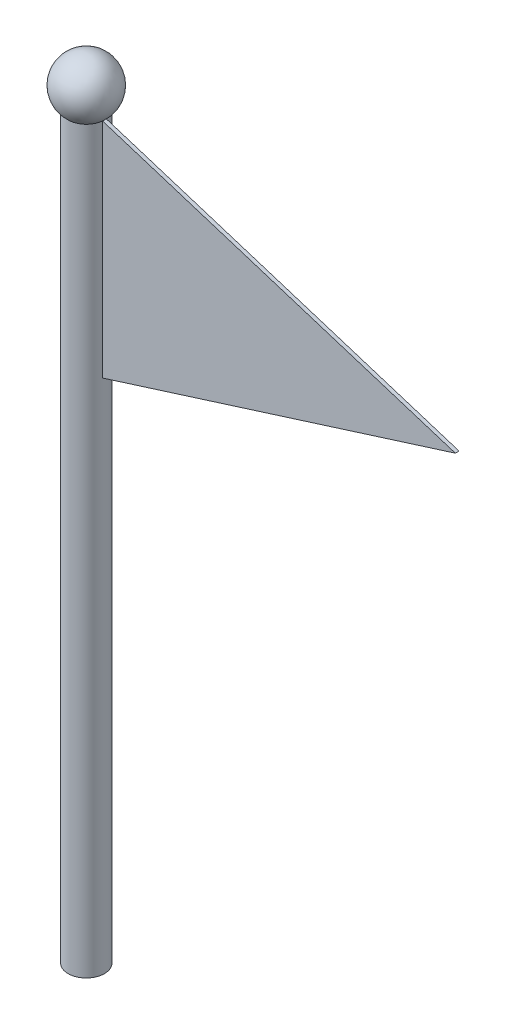
ISO-10303-21;
HEADER;
FILE_DESCRIPTION(('STEP AP214'),'2;1');
FILE_NAME('part.step','',(''),(''),'','','');
FILE_SCHEMA(('AUTOMOTIVE_DESIGN { 1 0 10303 214 1 1 1 1 }'));
ENDSEC;
DATA;
#1=APPLICATION_CONTEXT('core data for automotive mechanical design processes');
#2=APPLICATION_PROTOCOL_DEFINITION('international standard','automotive_design',2000,#1);
#3=PRODUCT_CONTEXT('',#1,'mechanical');
#4=PRODUCT('Part','Part','',(#3));
#5=PRODUCT_RELATED_PRODUCT_CATEGORY('part','',(#4));
#6=PRODUCT_DEFINITION_FORMATION('','',#4);
#7=PRODUCT_DEFINITION_CONTEXT('part definition',#1,'design');
#8=PRODUCT_DEFINITION('design','',#6,#7);
#9=PRODUCT_DEFINITION_SHAPE('','',#8);
#10=(LENGTH_UNIT() NAMED_UNIT(*) SI_UNIT(.MILLI.,.METRE.));
#11=(NAMED_UNIT(*) PLANE_ANGLE_UNIT() SI_UNIT($,.RADIAN.));
#12=(NAMED_UNIT(*) SI_UNIT($,.STERADIAN.) SOLID_ANGLE_UNIT());
#13=UNCERTAINTY_MEASURE_WITH_UNIT(LENGTH_MEASURE(1.E-05),#10,'distance_accuracy_value','');
#14=(GEOMETRIC_REPRESENTATION_CONTEXT(3) GLOBAL_UNCERTAINTY_ASSIGNED_CONTEXT((#13)) GLOBAL_UNIT_ASSIGNED_CONTEXT((#10,
#11,#12)) REPRESENTATION_CONTEXT('',''));
#15=CARTESIAN_POINT('',(0.,0.,0.));
#16=DIRECTION('',(0.,0.,1.));
#17=DIRECTION('',(1.,0.,0.));
#18=AXIS2_PLACEMENT_3D('',#15,#16,#17);
#19=CARTESIAN_POINT('',(0.,1000.,0.));
#20=DIRECTION('',(0.,-1.,0.));
#21=DIRECTION('',(0.,0.,-1.));
#22=AXIS2_PLACEMENT_3D('',#19,#20,#21);
#23=CYLINDRICAL_SURFACE('',#22,24.5);
#24=CARTESIAN_POINT('',(0.,0.,0.));
#25=DIRECTION('',(0.,1.,0.));
#26=DIRECTION('',(0.,0.,1.));
#27=AXIS2_PLACEMENT_3D('',#24,#25,#26);
#28=CIRCLE('',#27,24.5);
#29=CARTESIAN_POINT('',(0.,0.,24.5));
#30=VERTEX_POINT('',#29);
#31=EDGE_CURVE('E150',#30,#30,#28,.T.);
#32=ORIENTED_EDGE('',*,*,#31,.T.);
#33=EDGE_LOOP('',(#32));
#34=FACE_BOUND('',#33,.T.);
#35=CARTESIAN_POINT('',(0.,696.609860866843,0.));
#36=DIRECTION('',(0.,1.,0.));
#37=DIRECTION('',(0.,0.,1.));
#38=AXIS2_PLACEMENT_3D('',#35,#36,#37);
#39=CIRCLE('',#38,24.5);
#40=CARTESIAN_POINT('',(24.3721152139079,696.609860866843,2.5));
#41=VERTEX_POINT('',#40);
#42=CARTESIAN_POINT('',(24.5,696.609860866843,0.));
#43=VERTEX_POINT('',#42);
#44=EDGE_CURVE('E11',#41,#43,#39,.T.);
#45=ORIENTED_EDGE('',*,*,#44,.F.);
#46=DIRECTION('',(0.,-1.,0.));
#47=VECTOR('',#46,1.);
#48=CARTESIAN_POINT('',(24.3721152139079,1000.,2.5));
#49=LINE('',#48,#47);
#50=CARTESIAN_POINT('',(24.3721152139079,996.609860866843,2.5));
#51=VERTEX_POINT('',#50);
#52=EDGE_CURVE('E102',#41,#51,#49,.F.);
#53=ORIENTED_EDGE('',*,*,#52,.T.);
#54=CARTESIAN_POINT('',(0.,996.609860866843,0.));
#55=DIRECTION('',(0.,0.999999999999999,0.));
#56=DIRECTION('',(0.,0.,1.));
#57=AXIS2_PLACEMENT_3D('',#54,#55,#56);
#58=CIRCLE('',#57,24.5);
#59=CARTESIAN_POINT('',(24.3721152139079,996.609860866843,-2.5));
#60=VERTEX_POINT('',#59);
#61=EDGE_CURVE('E153',#60,#51,#58,.T.);
#62=ORIENTED_EDGE('',*,*,#61,.F.);
#63=DIRECTION('',(0.,-1.,0.));
#64=VECTOR('',#63,1.);
#65=CARTESIAN_POINT('',(24.3721152139079,1000.,-2.5));
#66=LINE('',#65,#64);
#67=CARTESIAN_POINT('',(24.3721152139079,696.609860866843,-2.5));
#68=VERTEX_POINT('',#67);
#69=EDGE_CURVE('E112',#68,#60,#66,.F.);
#70=ORIENTED_EDGE('',*,*,#69,.F.);
#71=EDGE_CURVE('E46',#43,#68,#39,.T.);
#72=ORIENTED_EDGE('',*,*,#71,.F.);
#73=EDGE_LOOP('',(#45,#53,#62,#70,#72));
#74=FACE_BOUND('',#73,.T.);
#75=ADVANCED_FACE('F43',(#34,#74),#23,.T.);
#76=CARTESIAN_POINT('',(0.,0.,0.));
#77=DIRECTION('',(0.,1.,0.));
#78=DIRECTION('',(0.,0.,1.));
#79=AXIS2_PLACEMENT_3D('',#76,#77,#78);
#80=PLANE('',#79);
#81=ORIENTED_EDGE('',*,*,#31,.F.);
#82=EDGE_LOOP('',(#81));
#83=FACE_BOUND('',#82,.T.);
#84=ADVANCED_FACE('F192',(#83),#80,.F.);
#85=CARTESIAN_POINT('',(0.,1025.,0.));
#86=DIRECTION('',(0.,1.,0.));
#87=DIRECTION('',(-1.,0.,0.));
#88=AXIS2_PLACEMENT_3D('',#85,#86,#87);
#89=SPHERICAL_SURFACE('',#88,37.5);
#90=CARTESIAN_POINT('',(24.5,996.609860866843,0.));
#91=VERTEX_POINT('',#90);
#92=EDGE_CURVE('E154',#51,#91,#58,.T.);
#93=ORIENTED_EDGE('',*,*,#92,.T.);
#94=EDGE_CURVE('E157',#91,#60,#58,.T.);
#95=ORIENTED_EDGE('',*,*,#94,.T.);
#96=ORIENTED_EDGE('',*,*,#61,.T.);
#97=EDGE_LOOP('',(#93,#95,#96));
#98=FACE_BOUND('',#97,.T.);
#99=ADVANCED_FACE('F165',(#98),#89,.T.);
#100=CARTESIAN_POINT('',(24.5,696.609860866843,2.5));
#101=DIRECTION('',(0.,1.,0.));
#102=DIRECTION('',(0.,0.,1.));
#103=AXIS2_PLACEMENT_3D('',#100,#101,#102);
#104=PLANE('',#103);
#105=DIRECTION('',(1.,0.,0.));
#106=VECTOR('',#105,1.);
#107=CARTESIAN_POINT('',(24.5,696.609860866843,2.5));
#108=LINE('',#107,#106);
#109=CARTESIAN_POINT('',(24.5,696.609860866843,2.5));
#110=VERTEX_POINT('',#109);
#111=EDGE_CURVE('E95',#41,#110,#108,.T.);
#112=ORIENTED_EDGE('',*,*,#111,.F.);
#113=ORIENTED_EDGE('',*,*,#44,.T.);
#114=DIRECTION('',(0.,0.,-1.));
#115=VECTOR('',#114,1.);
#116=CARTESIAN_POINT('',(24.5,696.609860866843,2.5));
#117=LINE('',#116,#115);
#118=EDGE_CURVE('E107',#110,#43,#117,.T.);
#119=ORIENTED_EDGE('',*,*,#118,.F.);
#120=EDGE_LOOP('',(#112,#113,#119));
#121=FACE_BOUND('',#120,.T.);
#122=ADVANCED_FACE('F108',(#121),#104,.F.);
#123=CARTESIAN_POINT('',(0.,996.609860866843,2.5));
#124=DIRECTION('',(0.,-1.,0.));
#125=DIRECTION('',(0.,0.,-1.));
#126=AXIS2_PLACEMENT_3D('',#123,#124,#125);
#127=PLANE('',#126);
#128=DIRECTION('',(-1.,0.,0.));
#129=VECTOR('',#128,1.);
#130=CARTESIAN_POINT('',(0.,996.609860866843,-2.5));
#131=LINE('',#130,#129);
#132=CARTESIAN_POINT('',(24.5,996.609860866843,-2.5));
#133=VERTEX_POINT('',#132);
#134=EDGE_CURVE('E127',#133,#60,#131,.T.);
#135=ORIENTED_EDGE('',*,*,#134,.T.);
#136=ORIENTED_EDGE('',*,*,#94,.F.);
#137=DIRECTION('',(0.,0.,-1.));
#138=VECTOR('',#137,1.);
#139=CARTESIAN_POINT('',(24.5,996.609860866843,2.5));
#140=LINE('',#139,#138);
#141=EDGE_CURVE('E123',#91,#133,#140,.T.);
#142=ORIENTED_EDGE('',*,*,#141,.T.);
#143=EDGE_LOOP('',(#135,#136,#142));
#144=FACE_BOUND('',#143,.T.);
#145=ADVANCED_FACE('F182',(#144),#127,.F.);
#146=CARTESIAN_POINT('',(24.5,996.609860866843,2.5));
#147=VERTEX_POINT('',#146);
#148=EDGE_CURVE('E58',#147,#91,#140,.T.);
#149=ORIENTED_EDGE('',*,*,#148,.T.);
#150=ORIENTED_EDGE('',*,*,#92,.F.);
#151=DIRECTION('',(-1.,0.,0.));
#152=VECTOR('',#151,1.);
#153=CARTESIAN_POINT('',(0.,996.609860866843,2.5));
#154=LINE('',#153,#152);
#155=EDGE_CURVE('E104',#147,#51,#154,.T.);
#156=ORIENTED_EDGE('',*,*,#155,.F.);
#157=EDGE_LOOP('',(#149,#150,#156));
#158=FACE_BOUND('',#157,.T.);
#159=ADVANCED_FACE('F180',(#158),#127,.F.);
#160=CARTESIAN_POINT('',(24.5,696.609860866843,-2.5));
#161=VERTEX_POINT('',#160);
#162=EDGE_CURVE('E113',#43,#161,#117,.T.);
#163=ORIENTED_EDGE('',*,*,#162,.F.);
#164=ORIENTED_EDGE('',*,*,#71,.T.);
#165=DIRECTION('',(1.,0.,0.));
#166=VECTOR('',#165,1.);
#167=CARTESIAN_POINT('',(24.5,696.609860866843,-2.5));
#168=LINE('',#167,#166);
#169=EDGE_CURVE('E131',#68,#161,#168,.T.);
#170=ORIENTED_EDGE('',*,*,#169,.T.);
#171=EDGE_LOOP('',(#163,#164,#170));
#172=FACE_BOUND('',#171,.T.);
#173=ADVANCED_FACE('F171',(#172),#104,.F.);
#174=CARTESIAN_POINT('',(500.,846.609860866843,2.5));
#175=DIRECTION('',(-0.300843393276318,0.953673556685929,0.));
#176=DIRECTION('',(-0.95367355668593,-0.300843393276318,0.));
#177=AXIS2_PLACEMENT_3D('',#174,#175,#176);
#178=PLANE('',#177);
#179=DIRECTION('',(0.953673556685929,0.300843393276318,0.));
#180=VECTOR('',#179,1.);
#181=CARTESIAN_POINT('',(500.,846.609860866843,-2.5));
#182=LINE('',#181,#180);
#183=CARTESIAN_POINT('',(500.,846.609860866843,-2.5));
#184=VERTEX_POINT('',#183);
#185=EDGE_CURVE('E135',#161,#184,#182,.T.);
#186=ORIENTED_EDGE('',*,*,#185,.T.);
#187=DIRECTION('',(0.,0.,-1.));
#188=VECTOR('',#187,1.);
#189=CARTESIAN_POINT('',(500.,846.609860866843,2.5));
#190=LINE('',#189,#188);
#191=CARTESIAN_POINT('',(500.,846.609860866843,2.5));
#192=VERTEX_POINT('',#191);
#193=EDGE_CURVE('E117',#192,#184,#190,.T.);
#194=ORIENTED_EDGE('',*,*,#193,.F.);
#195=DIRECTION('',(0.953673556685929,0.300843393276318,0.));
#196=VECTOR('',#195,1.);
#197=CARTESIAN_POINT('',(500.,846.609860866843,2.5));
#198=LINE('',#197,#196);
#199=EDGE_CURVE('E98',#110,#192,#198,.T.);
#200=ORIENTED_EDGE('',*,*,#199,.F.);
#201=ORIENTED_EDGE('',*,*,#118,.T.);
#202=ORIENTED_EDGE('',*,*,#162,.T.);
#203=EDGE_LOOP('',(#186,#194,#200,#201,#202));
#204=FACE_BOUND('',#203,.T.);
#205=ADVANCED_FACE('F115',(#204),#178,.F.);
#206=CARTESIAN_POINT('',(24.5,996.609860866843,2.5));
#207=DIRECTION('',(-0.300843393276318,-0.953673556685929,0.));
#208=DIRECTION('',(0.953673556685929,-0.300843393276318,0.));
#209=AXIS2_PLACEMENT_3D('',#206,#207,#208);
#210=PLANE('',#209);
#211=DIRECTION('',(-0.953673556685929,0.300843393276318,0.));
#212=VECTOR('',#211,1.);
#213=CARTESIAN_POINT('',(24.5,996.609860866843,-2.5));
#214=LINE('',#213,#212);
#215=EDGE_CURVE('E138',#184,#133,#214,.T.);
#216=ORIENTED_EDGE('',*,*,#215,.T.);
#217=ORIENTED_EDGE('',*,*,#141,.F.);
#218=ORIENTED_EDGE('',*,*,#148,.F.);
#219=DIRECTION('',(-0.953673556685929,0.300843393276318,0.));
#220=VECTOR('',#219,1.);
#221=CARTESIAN_POINT('',(24.5,996.609860866843,2.5));
#222=LINE('',#221,#220);
#223=EDGE_CURVE('E120',#192,#147,#222,.T.);
#224=ORIENTED_EDGE('',*,*,#223,.F.);
#225=ORIENTED_EDGE('',*,*,#193,.T.);
#226=EDGE_LOOP('',(#216,#217,#218,#224,#225));
#227=FACE_BOUND('',#226,.T.);
#228=ADVANCED_FACE('F178',(#227),#210,.F.);
#229=CARTESIAN_POINT('',(0.,0.,2.5));
#230=DIRECTION('',(0.,0.,1.));
#231=DIRECTION('',(1.,0.,0.));
#232=AXIS2_PLACEMENT_3D('',#229,#230,#231);
#233=PLANE('',#232);
#234=ORIENTED_EDGE('',*,*,#52,.F.);
#235=ORIENTED_EDGE('',*,*,#111,.T.);
#236=ORIENTED_EDGE('',*,*,#199,.T.);
#237=ORIENTED_EDGE('',*,*,#223,.T.);
#238=ORIENTED_EDGE('',*,*,#155,.T.);
#239=EDGE_LOOP('',(#234,#235,#236,#237,#238));
#240=FACE_BOUND('',#239,.T.);
#241=ADVANCED_FACE('F96',(#240),#233,.T.);
#242=CARTESIAN_POINT('',(0.,0.,-2.5));
#243=DIRECTION('',(0.,0.,1.));
#244=DIRECTION('',(1.,0.,0.));
#245=AXIS2_PLACEMENT_3D('',#242,#243,#244);
#246=PLANE('',#245);
#247=ORIENTED_EDGE('',*,*,#169,.F.);
#248=ORIENTED_EDGE('',*,*,#69,.T.);
#249=ORIENTED_EDGE('',*,*,#134,.F.);
#250=ORIENTED_EDGE('',*,*,#215,.F.);
#251=ORIENTED_EDGE('',*,*,#185,.F.);
#252=EDGE_LOOP('',(#247,#248,#249,#250,#251));
#253=FACE_BOUND('',#252,.T.);
#254=ADVANCED_FACE('F174',(#253),#246,.F.);
#255=CLOSED_SHELL('',(#75,#84,#99,#122,#145,#159,#173,#205,#228,#241,#254));
#256=MANIFOLD_SOLID_BREP('B2',#255);
#257=ADVANCED_BREP_SHAPE_REPRESENTATION('',(#18,#256),#14);
#258=SHAPE_DEFINITION_REPRESENTATION(#9,#257);
ENDSEC;
END-ISO-10303-21;
